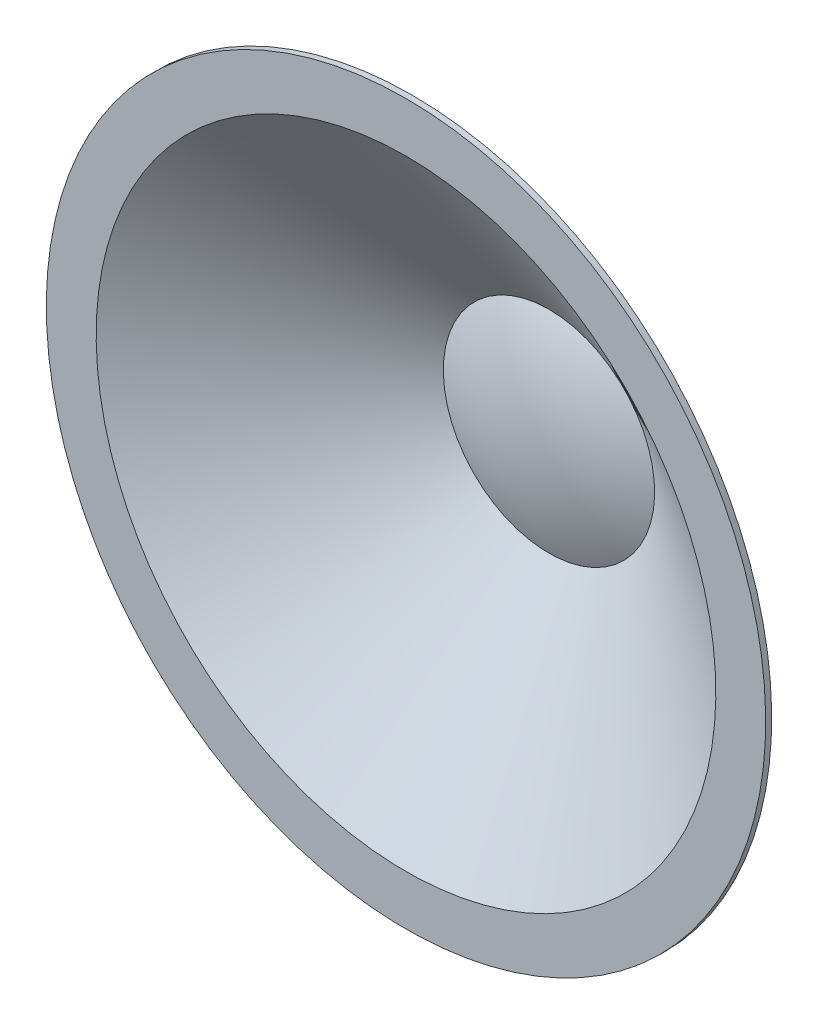
ISO-10303-21;
HEADER;
FILE_DESCRIPTION(('STEP AP214'),'2;1');
FILE_NAME('part.step','',(''),(''),'','','');
FILE_SCHEMA(('AUTOMOTIVE_DESIGN { 1 0 10303 214 1 1 1 1 }'));
ENDSEC;
DATA;
#1=APPLICATION_CONTEXT('core data for automotive mechanical design processes');
#2=APPLICATION_PROTOCOL_DEFINITION('international standard','automotive_design',2000,#1);
#3=PRODUCT_CONTEXT('',#1,'mechanical');
#4=PRODUCT('Part','Part','',(#3));
#5=PRODUCT_RELATED_PRODUCT_CATEGORY('part','',(#4));
#6=PRODUCT_DEFINITION_FORMATION('','',#4);
#7=PRODUCT_DEFINITION_CONTEXT('part definition',#1,'design');
#8=PRODUCT_DEFINITION('design','',#6,#7);
#9=PRODUCT_DEFINITION_SHAPE('','',#8);
#10=(LENGTH_UNIT() NAMED_UNIT(*) SI_UNIT(.MILLI.,.METRE.));
#11=(NAMED_UNIT(*) PLANE_ANGLE_UNIT() SI_UNIT($,.RADIAN.));
#12=(NAMED_UNIT(*) SI_UNIT($,.STERADIAN.) SOLID_ANGLE_UNIT());
#13=UNCERTAINTY_MEASURE_WITH_UNIT(LENGTH_MEASURE(1.E-05),#10,'distance_accuracy_value','');
#14=(GEOMETRIC_REPRESENTATION_CONTEXT(3) GLOBAL_UNCERTAINTY_ASSIGNED_CONTEXT((#13)) GLOBAL_UNIT_ASSIGNED_CONTEXT((#10,
#11,#12)) REPRESENTATION_CONTEXT('',''));
#15=CARTESIAN_POINT('',(0.,0.,0.));
#16=DIRECTION('',(0.,0.,1.));
#17=DIRECTION('',(1.,0.,0.));
#18=AXIS2_PLACEMENT_3D('',#15,#16,#17);
#19=CARTESIAN_POINT('',(0.,0.,-30.6347531980435));
#20=DIRECTION('',(0.,0.,-1.));
#21=DIRECTION('',(0.,1.,0.));
#22=AXIS2_PLACEMENT_3D('',#19,#20,#21);
#23=SPHERICAL_SURFACE('',#22,21.1347531980435);
#24=CARTESIAN_POINT('',(0.,0.,-11.4247268203114));
#25=DIRECTION('',(0.,0.,-1.));
#26=DIRECTION('',(0.,1.,0.));
#27=AXIS2_PLACEMENT_3D('',#24,#25,#26);
#28=CIRCLE('',#27,8.81207576618856);
#29=CARTESIAN_POINT('',(0.,8.81207576618856,-11.4247268203114));
#30=VERTEX_POINT('',#29);
#31=EDGE_CURVE('E56',#30,#30,#28,.T.);
#32=ORIENTED_EDGE('',*,*,#31,.F.);
#33=EDGE_LOOP('',(#32));
#34=FACE_BOUND('',#33,.T.);
#35=ADVANCED_FACE('F34',(#34),#23,.T.);
#36=CARTESIAN_POINT('',(0.,0.,-30.6347531980435));
#37=DIRECTION('',(0.,0.,-1.));
#38=DIRECTION('',(0.,1.,0.));
#39=AXIS2_PLACEMENT_3D('',#36,#37,#38);
#40=SPHERICAL_SURFACE('',#39,20.6347531980435);
#41=CARTESIAN_POINT('',(0.,0.,-12.));
#42=DIRECTION('',(0.,0.,-1.));
#43=DIRECTION('',(0.,1.,0.));
#44=AXIS2_PLACEMENT_3D('',#41,#42,#43);
#45=CIRCLE('',#44,8.86222391909467);
#46=CARTESIAN_POINT('',(0.,8.86222391909467,-12.));
#47=VERTEX_POINT('',#46);
#48=EDGE_CURVE('E10',#47,#47,#45,.T.);
#49=ORIENTED_EDGE('',*,*,#48,.T.);
#50=EDGE_LOOP('',(#49));
#51=FACE_BOUND('',#50,.T.);
#52=ADVANCED_FACE('F64',(#51),#40,.F.);
#53=CARTESIAN_POINT('',(0.,0.,0.));
#54=DIRECTION('',(0.,0.,1.));
#55=DIRECTION('',(0.,-1.,0.));
#56=AXIS2_PLACEMENT_3D('',#53,#54,#55);
#57=CONICAL_SURFACE('',#56,26.,0.95993108859688);
#58=ORIENTED_EDGE('',*,*,#48,.F.);
#59=EDGE_LOOP('',(#58));
#60=FACE_BOUND('',#59,.T.);
#61=CARTESIAN_POINT('',(0.,0.,0.));
#62=DIRECTION('',(0.,0.,-1.));
#63=DIRECTION('',(0.,1.,0.));
#64=AXIS2_PLACEMENT_3D('',#61,#62,#63);
#65=CIRCLE('',#64,26.);
#66=CARTESIAN_POINT('',(0.,26.,0.));
#67=VERTEX_POINT('',#66);
#68=EDGE_CURVE('E40',#67,#67,#65,.T.);
#69=ORIENTED_EDGE('',*,*,#68,.T.);
#70=EDGE_LOOP('',(#69));
#71=FACE_BOUND('',#70,.T.);
#72=ADVANCED_FACE('F68',(#60,#71),#57,.T.);
#73=CARTESIAN_POINT('',(0.,30.,0.));
#74=DIRECTION('',(0.,0.,1.));
#75=DIRECTION('',(0.,-1.,0.));
#76=AXIS2_PLACEMENT_3D('',#73,#74,#75);
#77=PLANE('',#76);
#78=ORIENTED_EDGE('',*,*,#68,.F.);
#79=EDGE_LOOP('',(#78));
#80=FACE_BOUND('',#79,.T.);
#81=CARTESIAN_POINT('',(0.,0.,0.));
#82=DIRECTION('',(0.,0.,-1.));
#83=DIRECTION('',(0.,1.,0.));
#84=AXIS2_PLACEMENT_3D('',#81,#82,#83);
#85=CIRCLE('',#84,30.);
#86=CARTESIAN_POINT('',(0.,30.,0.));
#87=VERTEX_POINT('',#86);
#88=EDGE_CURVE('E44',#87,#87,#85,.T.);
#89=ORIENTED_EDGE('',*,*,#88,.T.);
#90=EDGE_LOOP('',(#89));
#91=FACE_BOUND('',#90,.T.);
#92=ADVANCED_FACE('F72',(#80,#91),#77,.F.);
#93=CARTESIAN_POINT('',(0.,0.,-12.));
#94=DIRECTION('',(0.,0.,-1.));
#95=DIRECTION('',(0.,1.,0.));
#96=AXIS2_PLACEMENT_3D('',#93,#94,#95);
#97=CYLINDRICAL_SURFACE('',#96,30.);
#98=ORIENTED_EDGE('',*,*,#88,.F.);
#99=EDGE_LOOP('',(#98));
#100=FACE_BOUND('',#99,.T.);
#101=CARTESIAN_POINT('',(0.,0.,0.5));
#102=DIRECTION('',(0.,0.,-1.));
#103=DIRECTION('',(0.,1.,0.));
#104=AXIS2_PLACEMENT_3D('',#101,#102,#103);
#105=CIRCLE('',#104,30.);
#106=CARTESIAN_POINT('',(0.,30.,0.500000000000001));
#107=VERTEX_POINT('',#106);
#108=EDGE_CURVE('E48',#107,#107,#105,.T.);
#109=ORIENTED_EDGE('',*,*,#108,.T.);
#110=EDGE_LOOP('',(#109));
#111=FACE_BOUND('',#110,.T.);
#112=ADVANCED_FACE('F78',(#100,#111),#97,.T.);
#113=CARTESIAN_POINT('',(0.,30.,0.5));
#114=DIRECTION('',(0.,0.,1.));
#115=DIRECTION('',(0.,-1.,0.));
#116=AXIS2_PLACEMENT_3D('',#113,#114,#115);
#117=PLANE('',#116);
#118=CARTESIAN_POINT('',(0.,0.,0.499999999999999));
#119=DIRECTION('',(0.,0.,-1.));
#120=DIRECTION('',(0.,1.,0.));
#121=AXIS2_PLACEMENT_3D('',#118,#119,#120);
#122=CIRCLE('',#121,25.8423506055605);
#123=CARTESIAN_POINT('',(0.,25.8423506055605,0.499999999999999));
#124=VERTEX_POINT('',#123);
#125=EDGE_CURVE('E53',#124,#124,#122,.T.);
#126=ORIENTED_EDGE('',*,*,#125,.T.);
#127=EDGE_LOOP('',(#126));
#128=FACE_BOUND('',#127,.T.);
#129=ORIENTED_EDGE('',*,*,#108,.F.);
#130=EDGE_LOOP('',(#129));
#131=FACE_BOUND('',#130,.T.);
#132=ADVANCED_FACE('F82',(#128,#131),#117,.T.);
#133=CARTESIAN_POINT('',(0.,0.,0.499999999999999));
#134=DIRECTION('',(0.,0.,1.));
#135=DIRECTION('',(0.,-1.,0.));
#136=AXIS2_PLACEMENT_3D('',#133,#134,#135);
#137=CONICAL_SURFACE('',#136,25.8423506055605,0.95993108859688);
#138=ORIENTED_EDGE('',*,*,#31,.T.);
#139=EDGE_LOOP('',(#138));
#140=FACE_BOUND('',#139,.T.);
#141=ORIENTED_EDGE('',*,*,#125,.F.);
#142=EDGE_LOOP('',(#141));
#143=FACE_BOUND('',#142,.T.);
#144=ADVANCED_FACE('F60',(#140,#143),#137,.F.);
#145=CLOSED_SHELL('',(#35,#52,#72,#92,#112,#132,#144));
#146=MANIFOLD_SOLID_BREP('B2',#145);
#147=ADVANCED_BREP_SHAPE_REPRESENTATION('',(#18,#146),#14);
#148=SHAPE_DEFINITION_REPRESENTATION(#9,#147);
ENDSEC;
END-ISO-10303-21;
